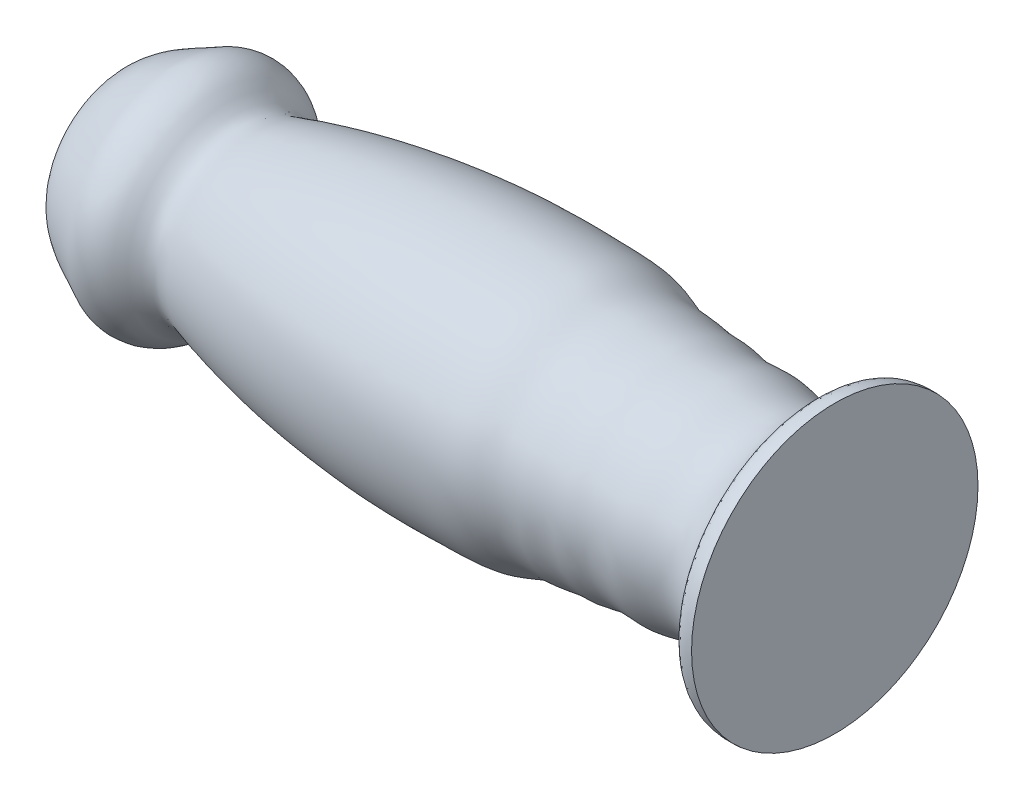
ISO-10303-21;
HEADER;
FILE_DESCRIPTION(('STEP AP214'),'2;1');
FILE_NAME('part.step','',(''),(''),'','','');
FILE_SCHEMA(('AUTOMOTIVE_DESIGN { 1 0 10303 214 1 1 1 1 }'));
ENDSEC;
DATA;
#1=APPLICATION_CONTEXT('core data for automotive mechanical design processes');
#2=APPLICATION_PROTOCOL_DEFINITION('international standard','automotive_design',2000,#1);
#3=PRODUCT_CONTEXT('',#1,'mechanical');
#4=PRODUCT('Part','Part','',(#3));
#5=PRODUCT_RELATED_PRODUCT_CATEGORY('part','',(#4));
#6=PRODUCT_DEFINITION_FORMATION('','',#4);
#7=PRODUCT_DEFINITION_CONTEXT('part definition',#1,'design');
#8=PRODUCT_DEFINITION('design','',#6,#7);
#9=PRODUCT_DEFINITION_SHAPE('','',#8);
#10=(LENGTH_UNIT() NAMED_UNIT(*) SI_UNIT(.MILLI.,.METRE.));
#11=(NAMED_UNIT(*) PLANE_ANGLE_UNIT() SI_UNIT($,.RADIAN.));
#12=(NAMED_UNIT(*) SI_UNIT($,.STERADIAN.) SOLID_ANGLE_UNIT());
#13=UNCERTAINTY_MEASURE_WITH_UNIT(LENGTH_MEASURE(1.E-05),#10,'distance_accuracy_value','');
#14=(GEOMETRIC_REPRESENTATION_CONTEXT(3) GLOBAL_UNCERTAINTY_ASSIGNED_CONTEXT((#13)) GLOBAL_UNIT_ASSIGNED_CONTEXT((#10,
#11,#12)) REPRESENTATION_CONTEXT('',''));
#15=CARTESIAN_POINT('',(0.,0.,0.));
#16=DIRECTION('',(0.,0.,1.));
#17=DIRECTION('',(1.,0.,0.));
#18=AXIS2_PLACEMENT_3D('',#15,#16,#17);
#19=CARTESIAN_POINT('',(76.2,0.,-15.2345328566005));
#20=CARTESIAN_POINT('',(75.7201040483911,0.,-15.2434196288952));
#21=CARTESIAN_POINT('',(74.5072062442839,0.,-15.3021484502872));
#22=CARTESIAN_POINT('',(73.3405511414585,0.,-12.1817777063821));
#23=CARTESIAN_POINT('',(69.2158186383306,0.,-9.25716668017729));
#24=CARTESIAN_POINT('',(64.4642135801345,0.,-11.3390143346259));
#25=CARTESIAN_POINT('',(60.989342374709,0.,-10.6347525165045));
#26=CARTESIAN_POINT('',(58.6812530897672,0.,-11.3603660937659));
#27=CARTESIAN_POINT('',(56.558148980343,0.,-11.2463253336103));
#28=CARTESIAN_POINT('',(54.6249247730208,0.,-11.7097150042917));
#29=CARTESIAN_POINT('',(52.1358008357531,0.,-11.6381729590119));
#30=CARTESIAN_POINT('',(49.2634433614773,0.,-13.0947113094747));
#31=CARTESIAN_POINT('',(45.5683821496167,0.,-13.1787354777495));
#32=CARTESIAN_POINT('',(40.3620421022192,0.,-13.2999723891617));
#33=CARTESIAN_POINT('',(35.4189659738642,0.,-13.1824098451558));
#34=CARTESIAN_POINT('',(28.7792721467143,0.,-12.5633147928834));
#35=CARTESIAN_POINT('',(23.071490120563,0.,-11.7187925264401));
#36=CARTESIAN_POINT('',(17.7420286075865,0.,-10.4734581931162));
#37=CARTESIAN_POINT('',(14.9296369601476,0.,-9.71621568059663));
#38=CARTESIAN_POINT('',(12.4486667152361,0.,-8.78028007005954));
#39=CARTESIAN_POINT('',(10.5484853354521,0.,-11.8001072516149));
#40=CARTESIAN_POINT('',(7.33142781533758,0.,-12.3666284865398));
#41=CARTESIAN_POINT('',(4.75236384047461,0.,-10.8812999962128));
#42=CARTESIAN_POINT('',(2.24885926651087,0.,-9.90528042059072));
#43=CARTESIAN_POINT('',(-0.326008406715289,0.,-7.61346417061476));
#44=CARTESIAN_POINT('',(0.166038155706628,0.,-4.24253513141563));
#45=CARTESIAN_POINT('',(-0.0142893913973015,0.,-1.4775087455368));
#46=CARTESIAN_POINT('',(0.,0.,0.));
#47=B_SPLINE_CURVE_WITH_KNOTS('',3,(#19,#20,#21,#22,#23,#24,#25,#26,#27,#28,#29,#30,#31,#32,#33,
#34,#35,#36,#37,#38,#39,#40,#41,#42,#43,#44,#45,#46),.UNSPECIFIED.,.F.,.F.,(4,1,1,1,1,1,1,1,1,1,
1,1,1,1,1,1,1,1,1,1,1,1,1,1,1,4),(0.,0.0182731713127855,0.0325723079270668,0.10506202039295,
0.160689422738565,0.197417781487066,0.222494772849736,0.241574814444588,0.269341409835402,
0.289869391047683,0.325414174768326,0.375858897294807,0.413999372664501,0.503851555824666,
0.544222186365117,0.641626344974932,0.701259660138487,0.72928022991409,0.743596423244295,
0.785488109942769,0.826017619589508,0.842326736850682,0.885424185849167,0.921311478548965,
0.94474874010697,1.),.UNSPECIFIED.);
#48=CARTESIAN_POINT('',(76.2,0.,0.));
#49=DIRECTION('',(1.,0.,0.));
#50=AXIS1_PLACEMENT('',#48,#49);
#51=SURFACE_OF_REVOLUTION('',#47,#50);
#52=CARTESIAN_POINT('',(0.,0.,0.));
#53=VERTEX_POINT('',#52);
#54=VERTEX_LOOP('',#53);
#55=FACE_BOUND('',#54,.T.);
#56=CARTESIAN_POINT('',(76.2,0.,0.));
#57=DIRECTION('',(1.,0.,0.));
#58=DIRECTION('',(0.,0.,-1.));
#59=AXIS2_PLACEMENT_3D('',#56,#57,#58);
#60=CIRCLE('',#59,15.2345328566005);
#61=CARTESIAN_POINT('',(76.2,0.,-15.2345328566005));
#62=VERTEX_POINT('',#61);
#63=EDGE_CURVE('E11',#62,#62,#60,.T.);
#64=ORIENTED_EDGE('',*,*,#63,.F.);
#65=EDGE_LOOP('',(#64));
#66=FACE_BOUND('',#65,.T.);
#67=ADVANCED_FACE('F37',(#55,#66),#51,.F.);
#68=CARTESIAN_POINT('',(76.2,0.,-15.2345328566005));
#69=DIRECTION('',(1.,0.,0.));
#70=DIRECTION('',(0.,0.,-1.));
#71=AXIS2_PLACEMENT_3D('',#68,#69,#70);
#72=PLANE('',#71);
#73=ORIENTED_EDGE('',*,*,#63,.T.);
#74=EDGE_LOOP('',(#73));
#75=FACE_BOUND('',#74,.T.);
#76=ADVANCED_FACE('F47',(#75),#72,.T.);
#77=CLOSED_SHELL('',(#67,#76));
#78=MANIFOLD_SOLID_BREP('B2',#77);
#79=ADVANCED_BREP_SHAPE_REPRESENTATION('',(#18,#78),#14);
#80=SHAPE_DEFINITION_REPRESENTATION(#9,#79);
ENDSEC;
END-ISO-10303-21;
